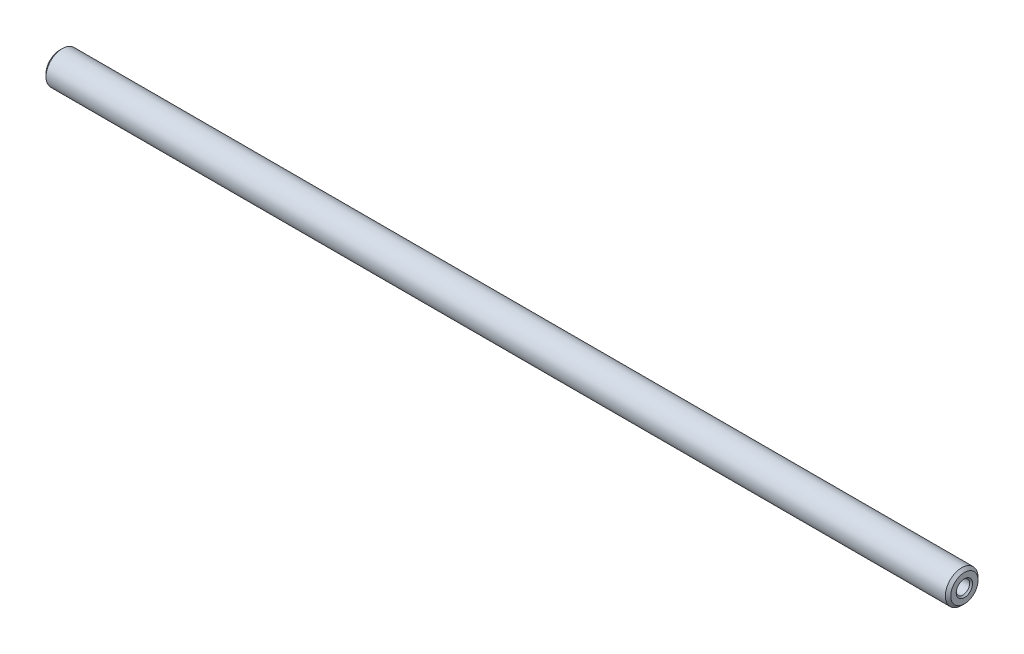
ISO-10303-21;
HEADER;
FILE_DESCRIPTION(('STEP AP214'),'2;1');
FILE_NAME('part.step','',(''),(''),'','','');
FILE_SCHEMA(('AUTOMOTIVE_DESIGN { 1 0 10303 214 1 1 1 1 }'));
ENDSEC;
DATA;
#1=APPLICATION_CONTEXT('core data for automotive mechanical design processes');
#2=APPLICATION_PROTOCOL_DEFINITION('international standard','automotive_design',2000,#1);
#3=PRODUCT_CONTEXT('',#1,'mechanical');
#4=PRODUCT('Part','Part','',(#3));
#5=PRODUCT_RELATED_PRODUCT_CATEGORY('part','',(#4));
#6=PRODUCT_DEFINITION_FORMATION('','',#4);
#7=PRODUCT_DEFINITION_CONTEXT('part definition',#1,'design');
#8=PRODUCT_DEFINITION('design','',#6,#7);
#9=PRODUCT_DEFINITION_SHAPE('','',#8);
#10=(LENGTH_UNIT() NAMED_UNIT(*) SI_UNIT(.MILLI.,.METRE.));
#11=(NAMED_UNIT(*) PLANE_ANGLE_UNIT() SI_UNIT($,.RADIAN.));
#12=(NAMED_UNIT(*) SI_UNIT($,.STERADIAN.) SOLID_ANGLE_UNIT());
#13=UNCERTAINTY_MEASURE_WITH_UNIT(LENGTH_MEASURE(1.E-05),#10,'distance_accuracy_value','');
#14=(GEOMETRIC_REPRESENTATION_CONTEXT(3) GLOBAL_UNCERTAINTY_ASSIGNED_CONTEXT((#13)) GLOBAL_UNIT_ASSIGNED_CONTEXT((#10,
#11,#12)) REPRESENTATION_CONTEXT('',''));
#15=CARTESIAN_POINT('',(0.,0.,0.));
#16=DIRECTION('',(0.,0.,1.));
#17=DIRECTION('',(1.,0.,0.));
#18=AXIS2_PLACEMENT_3D('',#15,#16,#17);
#19=CARTESIAN_POINT('',(165.999999999996,8.47207135175332E-09,0.));
#20=DIRECTION('',(-1.,0.,0.));
#21=DIRECTION('',(0.,0.,1.));
#22=AXIS2_PLACEMENT_3D('',#19,#20,#21);
#23=CYLINDRICAL_SURFACE('',#22,1.22949999152793);
#24=CARTESIAN_POINT('',(155.20985215597,8.47207135175332E-09,0.));
#25=DIRECTION('',(-1.,0.,0.));
#26=DIRECTION('',(0.,0.,1.));
#27=AXIS2_PLACEMENT_3D('',#24,#25,#26);
#28=CIRCLE('',#27,1.22949999152793);
#29=CARTESIAN_POINT('',(155.20985215597,8.47207135175332E-09,1.22949999152793));
#30=VERTEX_POINT('',#29);
#31=EDGE_CURVE('E11',#30,#30,#28,.T.);
#32=ORIENTED_EDGE('',*,*,#31,.T.);
#33=EDGE_LOOP('',(#32));
#34=FACE_BOUND('',#33,.T.);
#35=CARTESIAN_POINT('',(165.7295,8.47207135175332E-09,0.));
#36=DIRECTION('',(-1.,0.,0.));
#37=DIRECTION('',(0.,0.,1.));
#38=AXIS2_PLACEMENT_3D('',#35,#36,#37);
#39=CIRCLE('',#38,1.22949999152793);
#40=CARTESIAN_POINT('',(165.7295,8.47207135175332E-09,1.22949999152793));
#41=VERTEX_POINT('',#40);
#42=EDGE_CURVE('E56',#41,#41,#39,.T.);
#43=ORIENTED_EDGE('',*,*,#42,.F.);
#44=EDGE_LOOP('',(#43));
#45=FACE_BOUND('',#44,.T.);
#46=ADVANCED_FACE('F33',(#34,#45),#23,.F.);
#47=CARTESIAN_POINT('',(155.20985215597,8.47207135175332E-09,0.));
#48=DIRECTION('',(1.,0.,0.));
#49=DIRECTION('',(0.,0.,-1.));
#50=AXIS2_PLACEMENT_3D('',#47,#48,#49);
#51=CONICAL_SURFACE('',#50,1.22949999152793,1.04719755119659);
#52=CARTESIAN_POINT('',(154.500000004893,8.47207135175332E-09,0.));
#53=VERTEX_POINT('',#52);
#54=VERTEX_LOOP('',#53);
#55=FACE_BOUND('',#54,.T.);
#56=ORIENTED_EDGE('',*,*,#31,.F.);
#57=EDGE_LOOP('',(#56));
#58=FACE_BOUND('',#57,.T.);
#59=ADVANCED_FACE('F46',(#55,#58),#51,.F.);
#60=CARTESIAN_POINT('',(11.4999999999899,8.47207135175332E-09,0.));
#61=DIRECTION('',(-1.,0.,0.));
#62=DIRECTION('',(0.,0.,1.));
#63=AXIS2_PLACEMENT_3D('',#60,#61,#62);
#64=CONICAL_SURFACE('',#63,0.,1.04719754821881);
#65=CARTESIAN_POINT('',(10.790147844031,8.47207135175332E-09,0.));
#66=DIRECTION('',(-1.,0.,0.));
#67=DIRECTION('',(0.,0.,1.));
#68=AXIS2_PLACEMENT_3D('',#65,#66,#67);
#69=CIRCLE('',#68,1.22949999152793);
#70=CARTESIAN_POINT('',(10.790147844031,8.47207135175332E-09,1.22949999152793));
#71=VERTEX_POINT('',#70);
#72=EDGE_CURVE('E40',#71,#71,#69,.T.);
#73=ORIENTED_EDGE('',*,*,#72,.T.);
#74=EDGE_LOOP('',(#73));
#75=FACE_BOUND('',#74,.T.);
#76=CARTESIAN_POINT('',(11.4999999999899,8.47207135175332E-09,0.));
#77=VERTEX_POINT('',#76);
#78=VERTEX_LOOP('',#77);
#79=FACE_BOUND('',#78,.T.);
#80=ADVANCED_FACE('F49',(#75,#79),#64,.F.);
#81=CARTESIAN_POINT('',(165.999999999996,8.47207135175332E-09,0.));
#82=DIRECTION('',(-1.,0.,0.));
#83=DIRECTION('',(0.,0.,1.));
#84=AXIS2_PLACEMENT_3D('',#81,#82,#83);
#85=CYLINDRICAL_SURFACE('',#84,1.22949999152793);
#86=CARTESIAN_POINT('',(0.270500000000007,8.47207135175332E-09,0.));
#87=DIRECTION('',(-1.,0.,0.));
#88=DIRECTION('',(0.,0.,1.));
#89=AXIS2_PLACEMENT_3D('',#86,#87,#88);
#90=CIRCLE('',#89,1.22949999152793);
#91=CARTESIAN_POINT('',(0.270500000000007,8.47207135175332E-09,1.22949999152793));
#92=VERTEX_POINT('',#91);
#93=EDGE_CURVE('E78',#92,#92,#90,.T.);
#94=ORIENTED_EDGE('',*,*,#93,.T.);
#95=EDGE_LOOP('',(#94));
#96=FACE_BOUND('',#95,.T.);
#97=ORIENTED_EDGE('',*,*,#72,.F.);
#98=EDGE_LOOP('',(#97));
#99=FACE_BOUND('',#98,.T.);
#100=ADVANCED_FACE('F84',(#96,#99),#85,.F.);
#101=CARTESIAN_POINT('',(0.270500000000007,8.47207135175332E-09,0.));
#102=DIRECTION('',(-1.,0.,0.));
#103=DIRECTION('',(0.,0.,1.));
#104=AXIS2_PLACEMENT_3D('',#101,#102,#103);
#105=CONICAL_SURFACE('',#104,1.22949999152793,0.785398163397436);
#106=CARTESIAN_POINT('',(0.,8.47207135175332E-09,0.));
#107=DIRECTION('',(-1.,0.,0.));
#108=DIRECTION('',(0.,0.,1.));
#109=AXIS2_PLACEMENT_3D('',#106,#107,#108);
#110=CIRCLE('',#109,1.49999999152793);
#111=CARTESIAN_POINT('',(0.,8.47207135175332E-09,1.49999999152793));
#112=VERTEX_POINT('',#111);
#113=EDGE_CURVE('E75',#112,#112,#110,.T.);
#114=ORIENTED_EDGE('',*,*,#113,.T.);
#115=EDGE_LOOP('',(#114));
#116=FACE_BOUND('',#115,.T.);
#117=ORIENTED_EDGE('',*,*,#93,.F.);
#118=EDGE_LOOP('',(#117));
#119=FACE_BOUND('',#118,.T.);
#120=ADVANCED_FACE('F86',(#116,#119),#105,.F.);
#121=CARTESIAN_POINT('',(0.,1.5,0.));
#122=DIRECTION('',(-1.,0.,0.));
#123=DIRECTION('',(0.,0.,1.));
#124=AXIS2_PLACEMENT_3D('',#121,#122,#123);
#125=PLANE('',#124);
#126=CARTESIAN_POINT('',(0.,8.47207135175332E-09,0.));
#127=DIRECTION('',(-1.,0.,0.));
#128=DIRECTION('',(0.,0.,1.));
#129=AXIS2_PLACEMENT_3D('',#126,#127,#128);
#130=CIRCLE('',#129,2.49999999152793);
#131=CARTESIAN_POINT('',(0.,8.47207135175332E-09,2.49999999152793));
#132=VERTEX_POINT('',#131);
#133=EDGE_CURVE('E72',#132,#132,#130,.T.);
#134=ORIENTED_EDGE('',*,*,#133,.T.);
#135=EDGE_LOOP('',(#134));
#136=FACE_BOUND('',#135,.T.);
#137=ORIENTED_EDGE('',*,*,#113,.F.);
#138=EDGE_LOOP('',(#137));
#139=FACE_BOUND('',#138,.T.);
#140=ADVANCED_FACE('F93',(#136,#139),#125,.T.);
#141=CARTESIAN_POINT('',(0.,8.47207135175332E-09,0.));
#142=DIRECTION('',(1.,0.,0.));
#143=DIRECTION('',(0.,0.,-1.));
#144=AXIS2_PLACEMENT_3D('',#141,#142,#143);
#145=CONICAL_SURFACE('',#144,2.49999999152793,0.785398163397468);
#146=CARTESIAN_POINT('',(0.5,8.47207135175332E-09,0.));
#147=DIRECTION('',(-1.,0.,0.));
#148=DIRECTION('',(0.,0.,1.));
#149=AXIS2_PLACEMENT_3D('',#146,#147,#148);
#150=CIRCLE('',#149,2.99999999152795);
#151=CARTESIAN_POINT('',(0.5,8.47207135175332E-09,2.99999999152795));
#152=VERTEX_POINT('',#151);
#153=EDGE_CURVE('E69',#152,#152,#150,.T.);
#154=ORIENTED_EDGE('',*,*,#153,.T.);
#155=EDGE_LOOP('',(#154));
#156=FACE_BOUND('',#155,.T.);
#157=ORIENTED_EDGE('',*,*,#133,.F.);
#158=EDGE_LOOP('',(#157));
#159=FACE_BOUND('',#158,.T.);
#160=ADVANCED_FACE('F100',(#156,#159),#145,.T.);
#161=CARTESIAN_POINT('',(165.999999999996,8.47207135175332E-09,0.));
#162=DIRECTION('',(-1.,0.,0.));
#163=DIRECTION('',(0.,0.,1.));
#164=AXIS2_PLACEMENT_3D('',#161,#162,#163);
#165=CYLINDRICAL_SURFACE('',#164,2.99999999152794);
#166=CARTESIAN_POINT('',(165.5,8.47207135175332E-09,0.));
#167=DIRECTION('',(-1.,0.,0.));
#168=DIRECTION('',(0.,0.,1.));
#169=AXIS2_PLACEMENT_3D('',#166,#167,#168);
#170=CIRCLE('',#169,2.99999999152793);
#171=CARTESIAN_POINT('',(165.5,8.47207135175332E-09,2.99999999152793));
#172=VERTEX_POINT('',#171);
#173=EDGE_CURVE('E66',#172,#172,#170,.T.);
#174=ORIENTED_EDGE('',*,*,#173,.T.);
#175=EDGE_LOOP('',(#174));
#176=FACE_BOUND('',#175,.T.);
#177=ORIENTED_EDGE('',*,*,#153,.F.);
#178=EDGE_LOOP('',(#177));
#179=FACE_BOUND('',#178,.T.);
#180=ADVANCED_FACE('F104',(#176,#179),#165,.T.);
#181=CARTESIAN_POINT('',(165.5,8.47207135175332E-09,0.));
#182=DIRECTION('',(-1.,0.,0.));
#183=DIRECTION('',(0.,0.,1.));
#184=AXIS2_PLACEMENT_3D('',#181,#182,#183);
#185=CONICAL_SURFACE('',#184,2.99999999152793,0.785398163397448);
#186=CARTESIAN_POINT('',(166.,8.47207135175332E-09,0.));
#187=DIRECTION('',(-1.,0.,0.));
#188=DIRECTION('',(0.,0.,1.));
#189=AXIS2_PLACEMENT_3D('',#186,#187,#188);
#190=CIRCLE('',#189,2.49999999152793);
#191=CARTESIAN_POINT('',(166.,8.47207135175332E-09,2.49999999152793));
#192=VERTEX_POINT('',#191);
#193=EDGE_CURVE('E61',#192,#192,#190,.T.);
#194=ORIENTED_EDGE('',*,*,#193,.T.);
#195=EDGE_LOOP('',(#194));
#196=FACE_BOUND('',#195,.T.);
#197=ORIENTED_EDGE('',*,*,#173,.F.);
#198=EDGE_LOOP('',(#197));
#199=FACE_BOUND('',#198,.T.);
#200=ADVANCED_FACE('F108',(#196,#199),#185,.T.);
#201=CARTESIAN_POINT('',(166.,2.5,0.));
#202=DIRECTION('',(1.,0.,0.));
#203=DIRECTION('',(0.,0.,-1.));
#204=AXIS2_PLACEMENT_3D('',#201,#202,#203);
#205=PLANE('',#204);
#206=CARTESIAN_POINT('',(166.,8.47207135175332E-09,0.));
#207=DIRECTION('',(-1.,0.,0.));
#208=DIRECTION('',(0.,0.,1.));
#209=AXIS2_PLACEMENT_3D('',#206,#207,#208);
#210=CIRCLE('',#209,1.49999999152793);
#211=CARTESIAN_POINT('',(166.,8.47207135175332E-09,1.49999999152793));
#212=VERTEX_POINT('',#211);
#213=EDGE_CURVE('E58',#212,#212,#210,.T.);
#214=ORIENTED_EDGE('',*,*,#213,.T.);
#215=EDGE_LOOP('',(#214));
#216=FACE_BOUND('',#215,.T.);
#217=ORIENTED_EDGE('',*,*,#193,.F.);
#218=EDGE_LOOP('',(#217));
#219=FACE_BOUND('',#218,.T.);
#220=ADVANCED_FACE('F112',(#216,#219),#205,.T.);
#221=CARTESIAN_POINT('',(166.,8.47207135175332E-09,0.));
#222=DIRECTION('',(1.,0.,0.));
#223=DIRECTION('',(0.,0.,-1.));
#224=AXIS2_PLACEMENT_3D('',#221,#222,#223);
#225=CONICAL_SURFACE('',#224,1.49999999152793,0.785398163397435);
#226=ORIENTED_EDGE('',*,*,#42,.T.);
#227=EDGE_LOOP('',(#226));
#228=FACE_BOUND('',#227,.T.);
#229=ORIENTED_EDGE('',*,*,#213,.F.);
#230=EDGE_LOOP('',(#229));
#231=FACE_BOUND('',#230,.T.);
#232=ADVANCED_FACE('F116',(#228,#231),#225,.F.);
#233=CLOSED_SHELL('',(#46,#59,#80,#100,#120,#140,#160,#180,#200,#220,#232));
#234=MANIFOLD_SOLID_BREP('B2',#233);
#235=ADVANCED_BREP_SHAPE_REPRESENTATION('',(#18,#234),#14);
#236=SHAPE_DEFINITION_REPRESENTATION(#9,#235);
ENDSEC;
END-ISO-10303-21;
